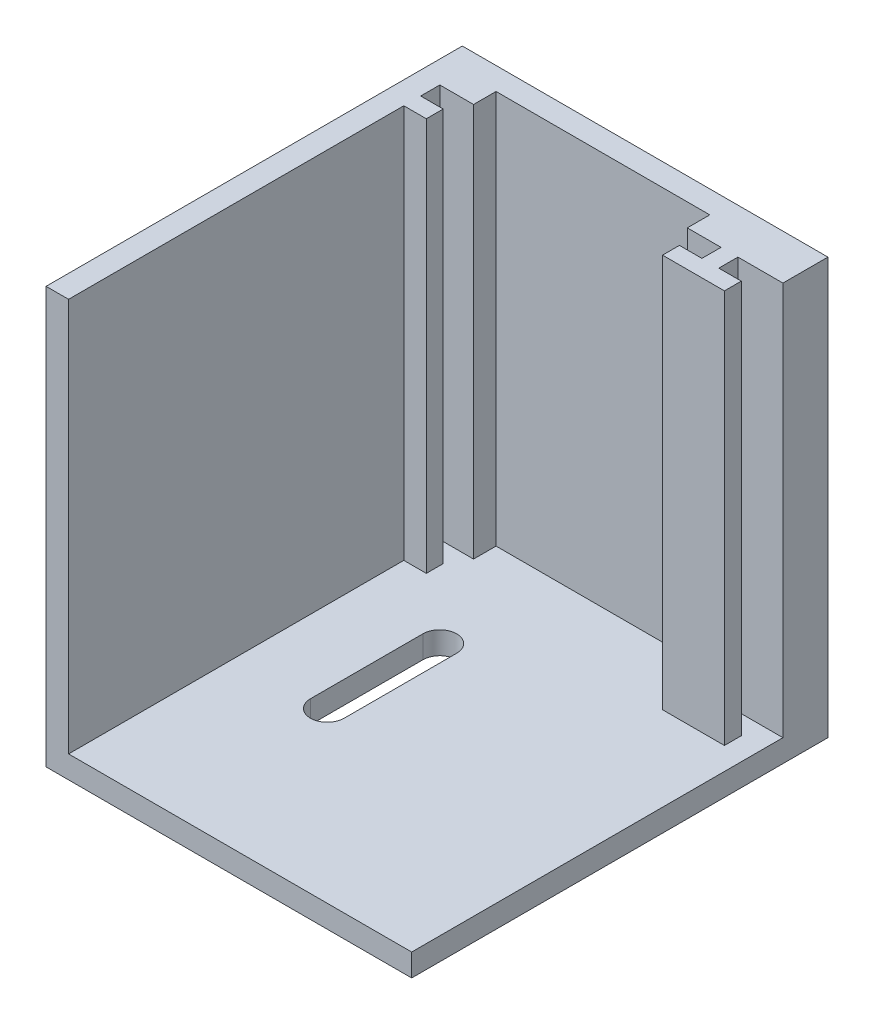
ISO-10303-21;
HEADER;
FILE_DESCRIPTION(('STEP AP214'),'2;1');
FILE_NAME('part.step','',(''),(''),'','','');
FILE_SCHEMA(('AUTOMOTIVE_DESIGN { 1 0 10303 214 1 1 1 1 }'));
ENDSEC;
DATA;
#1=APPLICATION_CONTEXT('core data for automotive mechanical design processes');
#2=APPLICATION_PROTOCOL_DEFINITION('international standard','automotive_design',2000,#1);
#3=PRODUCT_CONTEXT('',#1,'mechanical');
#4=PRODUCT('Part','Part','',(#3));
#5=PRODUCT_RELATED_PRODUCT_CATEGORY('part','',(#4));
#6=PRODUCT_DEFINITION_FORMATION('','',#4);
#7=PRODUCT_DEFINITION_CONTEXT('part definition',#1,'design');
#8=PRODUCT_DEFINITION('design','',#6,#7);
#9=PRODUCT_DEFINITION_SHAPE('','',#8);
#10=(LENGTH_UNIT() NAMED_UNIT(*) SI_UNIT(.MILLI.,.METRE.));
#11=(NAMED_UNIT(*) PLANE_ANGLE_UNIT() SI_UNIT($,.RADIAN.));
#12=(NAMED_UNIT(*) SI_UNIT($,.STERADIAN.) SOLID_ANGLE_UNIT());
#13=UNCERTAINTY_MEASURE_WITH_UNIT(LENGTH_MEASURE(1.E-05),#10,'distance_accuracy_value','');
#14=(GEOMETRIC_REPRESENTATION_CONTEXT(3) GLOBAL_UNCERTAINTY_ASSIGNED_CONTEXT((#13)) GLOBAL_UNIT_ASSIGNED_CONTEXT((#10,
#11,#12)) REPRESENTATION_CONTEXT('',''));
#15=CARTESIAN_POINT('',(0.,0.,0.));
#16=DIRECTION('',(0.,0.,1.));
#17=DIRECTION('',(1.,0.,0.));
#18=AXIS2_PLACEMENT_3D('',#15,#16,#17);
#19=CARTESIAN_POINT('',(14.,-16.,0.));
#20=DIRECTION('',(-1.,0.,0.));
#21=DIRECTION('',(0.,-1.,0.));
#22=AXIS2_PLACEMENT_3D('',#19,#20,#21);
#23=PLANE('',#22);
#24=DIRECTION('',(0.,1.,0.));
#25=VECTOR('',#24,1.);
#26=CARTESIAN_POINT('',(14.,-16.,4.));
#27=LINE('',#26,#25);
#28=CARTESIAN_POINT('',(14.,-16.,4.));
#29=VERTEX_POINT('',#28);
#30=CARTESIAN_POINT('',(14.,19.,4.));
#31=VERTEX_POINT('',#30);
#32=EDGE_CURVE('E59',#29,#31,#27,.T.);
#33=ORIENTED_EDGE('',*,*,#32,.T.);
#34=DIRECTION('',(0.,0.,1.));
#35=VECTOR('',#34,1.);
#36=CARTESIAN_POINT('',(14.,19.,2.));
#37=LINE('',#36,#35);
#38=CARTESIAN_POINT('',(14.,19.,5.7));
#39=VERTEX_POINT('',#38);
#40=EDGE_CURVE('E270',#31,#39,#37,.T.);
#41=ORIENTED_EDGE('',*,*,#40,.T.);
#42=DIRECTION('',(0.,1.,0.));
#43=VECTOR('',#42,1.);
#44=CARTESIAN_POINT('',(14.,-16.,5.7));
#45=LINE('',#44,#43);
#46=CARTESIAN_POINT('',(14.,-16.,5.70000000000001));
#47=VERTEX_POINT('',#46);
#48=EDGE_CURVE('E436',#47,#39,#45,.T.);
#49=ORIENTED_EDGE('',*,*,#48,.F.);
#50=DIRECTION('',(0.,0.,1.));
#51=VECTOR('',#50,1.);
#52=CARTESIAN_POINT('',(14.,-16.,2.));
#53=LINE('',#52,#51);
#54=EDGE_CURVE('E271',#29,#47,#53,.T.);
#55=ORIENTED_EDGE('',*,*,#54,.F.);
#56=EDGE_LOOP('',(#33,#41,#49,#55));
#57=FACE_BOUND('',#56,.T.);
#58=ADVANCED_FACE('F37',(#57),#23,.F.);
#59=CARTESIAN_POINT('',(-14.4999999999999,-16.,37.));
#60=DIRECTION('',(0.,-1.,0.));
#61=DIRECTION('',(0.,0.,-1.));
#62=AXIS2_PLACEMENT_3D('',#59,#60,#61);
#63=PLANE('',#62);
#64=DIRECTION('',(0.,0.,-1.));
#65=VECTOR('',#64,1.);
#66=CARTESIAN_POINT('',(-5.99999999999989,-16.,37.));
#67=LINE('',#66,#65);
#68=CARTESIAN_POINT('',(-5.99999999999989,-16.,22.));
#69=VERTEX_POINT('',#68);
#70=CARTESIAN_POINT('',(-5.99999999999989,-16.,12.));
#71=VERTEX_POINT('',#70);
#72=EDGE_CURVE('E45',#69,#71,#67,.T.);
#73=ORIENTED_EDGE('',*,*,#72,.T.);
#74=CARTESIAN_POINT('',(-4.49999999999989,-16.,12.));
#75=DIRECTION('',(0.,-1.,0.));
#76=DIRECTION('',(0.,0.,-1.));
#77=AXIS2_PLACEMENT_3D('',#74,#75,#76);
#78=CIRCLE('',#77,1.5);
#79=CARTESIAN_POINT('',(-2.99999999999989,-16.,12.));
#80=VERTEX_POINT('',#79);
#81=EDGE_CURVE('E11',#71,#80,#78,.T.);
#82=ORIENTED_EDGE('',*,*,#81,.T.);
#83=DIRECTION('',(0.,0.,1.));
#84=VECTOR('',#83,1.);
#85=CARTESIAN_POINT('',(-2.9999999999999,-16.,37.));
#86=LINE('',#85,#84);
#87=CARTESIAN_POINT('',(-2.9999999999999,-16.,22.));
#88=VERTEX_POINT('',#87);
#89=EDGE_CURVE('E375',#80,#88,#86,.T.);
#90=ORIENTED_EDGE('',*,*,#89,.T.);
#91=CARTESIAN_POINT('',(-4.49999999999989,-16.,22.));
#92=DIRECTION('',(0.,-1.,0.));
#93=DIRECTION('',(0.,0.,-1.));
#94=AXIS2_PLACEMENT_3D('',#91,#92,#93);
#95=CIRCLE('',#94,1.5);
#96=EDGE_CURVE('E378',#88,#69,#95,.T.);
#97=ORIENTED_EDGE('',*,*,#96,.T.);
#98=EDGE_LOOP('',(#73,#82,#90,#97));
#99=FACE_BOUND('',#98,.T.);
#100=DIRECTION('',(0.,0.,-1.));
#101=VECTOR('',#100,1.);
#102=CARTESIAN_POINT('',(18.0000000000001,-16.,37.));
#103=LINE('',#102,#101);
#104=CARTESIAN_POINT('',(18.0000000000001,-16.,37.));
#105=VERTEX_POINT('',#104);
#106=CARTESIAN_POINT('',(18.,-16.,4.));
#107=VERTEX_POINT('',#106);
#108=EDGE_CURVE('E227',#105,#107,#103,.T.);
#109=ORIENTED_EDGE('',*,*,#108,.T.);
#110=DIRECTION('',(-1.,0.,0.));
#111=VECTOR('',#110,1.);
#112=CARTESIAN_POINT('',(14.,-16.,4.));
#113=LINE('',#112,#111);
#114=EDGE_CURVE('E52',#107,#29,#113,.T.);
#115=ORIENTED_EDGE('',*,*,#114,.T.);
#116=ORIENTED_EDGE('',*,*,#54,.T.);
#117=DIRECTION('',(1.,0.,0.));
#118=VECTOR('',#117,1.);
#119=CARTESIAN_POINT('',(14.,-16.,5.7));
#120=LINE('',#119,#118);
#121=CARTESIAN_POINT('',(16.,-16.,5.7));
#122=VERTEX_POINT('',#121);
#123=EDGE_CURVE('E421',#47,#122,#120,.T.);
#124=ORIENTED_EDGE('',*,*,#123,.T.);
#125=DIRECTION('',(0.,0.,1.));
#126=VECTOR('',#125,1.);
#127=CARTESIAN_POINT('',(16.,-16.,7.2));
#128=LINE('',#127,#126);
#129=CARTESIAN_POINT('',(16.,-16.,7.2));
#130=VERTEX_POINT('',#129);
#131=EDGE_CURVE('E423',#122,#130,#128,.T.);
#132=ORIENTED_EDGE('',*,*,#131,.T.);
#133=DIRECTION('',(-1.,0.,0.));
#134=VECTOR('',#133,1.);
#135=CARTESIAN_POINT('',(0.,-16.,7.2));
#136=LINE('',#135,#134);
#137=CARTESIAN_POINT('',(10.5,-16.,7.2));
#138=VERTEX_POINT('',#137);
#139=EDGE_CURVE('E282',#130,#138,#136,.T.);
#140=ORIENTED_EDGE('',*,*,#139,.T.);
#141=DIRECTION('',(0.,0.,1.));
#142=VECTOR('',#141,1.);
#143=CARTESIAN_POINT('',(10.5,-16.,0.));
#144=LINE('',#143,#142);
#145=CARTESIAN_POINT('',(10.5,-16.,5.7));
#146=VERTEX_POINT('',#145);
#147=EDGE_CURVE('E293',#146,#138,#144,.T.);
#148=ORIENTED_EDGE('',*,*,#147,.F.);
#149=DIRECTION('',(-1.,0.,0.));
#150=VECTOR('',#149,1.);
#151=CARTESIAN_POINT('',(0.,-16.,5.7));
#152=LINE('',#151,#150);
#153=CARTESIAN_POINT('',(12.5,-16.,5.7));
#154=VERTEX_POINT('',#153);
#155=EDGE_CURVE('E288',#154,#146,#152,.T.);
#156=ORIENTED_EDGE('',*,*,#155,.F.);
#157=DIRECTION('',(0.,0.,1.));
#158=VECTOR('',#157,1.);
#159=CARTESIAN_POINT('',(12.5,-16.,2.));
#160=LINE('',#159,#158);
#161=CARTESIAN_POINT('',(12.5,-16.,4.));
#162=VERTEX_POINT('',#161);
#163=EDGE_CURVE('E274',#162,#154,#160,.T.);
#164=ORIENTED_EDGE('',*,*,#163,.F.);
#165=DIRECTION('',(1.,0.,0.));
#166=VECTOR('',#165,1.);
#167=CARTESIAN_POINT('',(12.5,-16.,4.));
#168=LINE('',#167,#166);
#169=CARTESIAN_POINT('',(9.5,-16.,4.));
#170=VERTEX_POINT('',#169);
#171=EDGE_CURVE('E333',#170,#162,#168,.T.);
#172=ORIENTED_EDGE('',*,*,#171,.F.);
#173=DIRECTION('',(0.,0.,-1.));
#174=VECTOR('',#173,1.);
#175=CARTESIAN_POINT('',(9.5,-16.,4.));
#176=LINE('',#175,#174);
#177=CARTESIAN_POINT('',(9.5,-16.,2.));
#178=VERTEX_POINT('',#177);
#179=EDGE_CURVE('E336',#170,#178,#176,.T.);
#180=ORIENTED_EDGE('',*,*,#179,.T.);
#181=DIRECTION('',(1.,0.,0.));
#182=VECTOR('',#181,1.);
#183=CARTESIAN_POINT('',(-14.4999999999999,-16.,2.));
#184=LINE('',#183,#182);
#185=CARTESIAN_POINT('',(-9.5,-16.,2.));
#186=VERTEX_POINT('',#185);
#187=EDGE_CURVE('E364',#186,#178,#184,.T.);
#188=ORIENTED_EDGE('',*,*,#187,.F.);
#189=DIRECTION('',(0.,0.,-1.));
#190=VECTOR('',#189,1.);
#191=CARTESIAN_POINT('',(-9.5,-16.,4.));
#192=LINE('',#191,#190);
#193=CARTESIAN_POINT('',(-9.5,-16.,4.));
#194=VERTEX_POINT('',#193);
#195=EDGE_CURVE('E360',#194,#186,#192,.T.);
#196=ORIENTED_EDGE('',*,*,#195,.F.);
#197=DIRECTION('',(1.,0.,0.));
#198=VECTOR('',#197,1.);
#199=CARTESIAN_POINT('',(-12.5,-16.,4.));
#200=LINE('',#199,#198);
#201=CARTESIAN_POINT('',(-12.5,-16.,4.));
#202=VERTEX_POINT('',#201);
#203=EDGE_CURVE('E347',#202,#194,#200,.T.);
#204=ORIENTED_EDGE('',*,*,#203,.F.);
#205=DIRECTION('',(0.,0.,1.));
#206=VECTOR('',#205,1.);
#207=CARTESIAN_POINT('',(-12.5,-16.,0.));
#208=LINE('',#207,#206);
#209=CARTESIAN_POINT('',(-12.5,-16.,5.7));
#210=VERTEX_POINT('',#209);
#211=EDGE_CURVE('E303',#202,#210,#208,.T.);
#212=ORIENTED_EDGE('',*,*,#211,.T.);
#213=DIRECTION('',(1.,0.,0.));
#214=VECTOR('',#213,1.);
#215=CARTESIAN_POINT('',(0.,-16.,5.7));
#216=LINE('',#215,#214);
#217=CARTESIAN_POINT('',(-10.5,-16.,5.7));
#218=VERTEX_POINT('',#217);
#219=EDGE_CURVE('E300',#210,#218,#216,.T.);
#220=ORIENTED_EDGE('',*,*,#219,.T.);
#221=DIRECTION('',(0.,0.,1.));
#222=VECTOR('',#221,1.);
#223=CARTESIAN_POINT('',(-10.5,-16.,0.));
#224=LINE('',#223,#222);
#225=CARTESIAN_POINT('',(-10.5,-16.,7.2));
#226=VERTEX_POINT('',#225);
#227=EDGE_CURVE('E298',#218,#226,#224,.T.);
#228=ORIENTED_EDGE('',*,*,#227,.T.);
#229=DIRECTION('',(1.,0.,0.));
#230=VECTOR('',#229,1.);
#231=CARTESIAN_POINT('',(0.,-16.,7.2));
#232=LINE('',#231,#230);
#233=CARTESIAN_POINT('',(-12.4999999999999,-16.,7.2));
#234=VERTEX_POINT('',#233);
#235=EDGE_CURVE('E305',#234,#226,#232,.T.);
#236=ORIENTED_EDGE('',*,*,#235,.F.);
#237=DIRECTION('',(0.,0.,-1.));
#238=VECTOR('',#237,1.);
#239=CARTESIAN_POINT('',(-12.4999999999999,-16.,37.));
#240=LINE('',#239,#238);
#241=CARTESIAN_POINT('',(-12.4999999999999,-16.,37.));
#242=VERTEX_POINT('',#241);
#243=EDGE_CURVE('E258',#242,#234,#240,.T.);
#244=ORIENTED_EDGE('',*,*,#243,.F.);
#245=DIRECTION('',(-1.,0.,0.));
#246=VECTOR('',#245,1.);
#247=CARTESIAN_POINT('',(-14.4999999999999,-16.,37.));
#248=LINE('',#247,#246);
#249=EDGE_CURVE('E234',#105,#242,#248,.T.);
#250=ORIENTED_EDGE('',*,*,#249,.F.);
#251=EDGE_LOOP('',(#109,#115,#116,#124,#132,#140,#148,#156,#164,#172,#180,#188,#196,#204,#212,
#220,#228,#236,#244,#250));
#252=FACE_BOUND('',#251,.T.);
#253=ADVANCED_FACE('F232',(#99,#252),#63,.F.);
#254=CARTESIAN_POINT('',(0.,-16.,7.2));
#255=DIRECTION('',(0.,0.,1.));
#256=DIRECTION('',(1.,0.,0.));
#257=AXIS2_PLACEMENT_3D('',#254,#255,#256);
#258=PLANE('',#257);
#259=DIRECTION('',(1.,0.,0.));
#260=VECTOR('',#259,1.);
#261=CARTESIAN_POINT('',(0.,19.,7.2));
#262=LINE('',#261,#260);
#263=CARTESIAN_POINT('',(-12.4999999999999,19.,7.2));
#264=VERTEX_POINT('',#263);
#265=CARTESIAN_POINT('',(-10.5,19.,7.2));
#266=VERTEX_POINT('',#265);
#267=EDGE_CURVE('E301',#264,#266,#262,.T.);
#268=ORIENTED_EDGE('',*,*,#267,.F.);
#269=DIRECTION('',(0.,-1.,0.));
#270=VECTOR('',#269,1.);
#271=CARTESIAN_POINT('',(-12.4999999999999,-16.,7.2));
#272=LINE('',#271,#270);
#273=EDGE_CURVE('E261',#264,#234,#272,.T.);
#274=ORIENTED_EDGE('',*,*,#273,.T.);
#275=ORIENTED_EDGE('',*,*,#235,.T.);
#276=DIRECTION('',(0.,1.,0.));
#277=VECTOR('',#276,1.);
#278=CARTESIAN_POINT('',(-10.5,-16.,7.2));
#279=LINE('',#278,#277);
#280=EDGE_CURVE('E316',#226,#266,#279,.T.);
#281=ORIENTED_EDGE('',*,*,#280,.T.);
#282=EDGE_LOOP('',(#268,#274,#275,#281));
#283=FACE_BOUND('',#282,.T.);
#284=ADVANCED_FACE('F470',(#283),#258,.T.);
#285=CARTESIAN_POINT('',(0.,0.,2.));
#286=DIRECTION('',(0.,0.,-1.));
#287=DIRECTION('',(-1.,0.,0.));
#288=AXIS2_PLACEMENT_3D('',#285,#286,#287);
#289=PLANE('',#288);
#290=DIRECTION('',(0.,-1.,0.));
#291=VECTOR('',#290,1.);
#292=CARTESIAN_POINT('',(9.5,19.,2.));
#293=LINE('',#292,#291);
#294=CARTESIAN_POINT('',(9.5,19.,2.));
#295=VERTEX_POINT('',#294);
#296=EDGE_CURVE('E319',#295,#178,#293,.T.);
#297=ORIENTED_EDGE('',*,*,#296,.F.);
#298=DIRECTION('',(-1.,0.,0.));
#299=VECTOR('',#298,1.);
#300=CARTESIAN_POINT('',(-14.5,19.,2.));
#301=LINE('',#300,#299);
#302=CARTESIAN_POINT('',(-9.50000000000001,19.,2.));
#303=VERTEX_POINT('',#302);
#304=EDGE_CURVE('E367',#295,#303,#301,.T.);
#305=ORIENTED_EDGE('',*,*,#304,.T.);
#306=DIRECTION('',(0.,1.,0.));
#307=VECTOR('',#306,1.);
#308=CARTESIAN_POINT('',(-9.50000000000001,19.,2.));
#309=LINE('',#308,#307);
#310=EDGE_CURVE('E343',#186,#303,#309,.T.);
#311=ORIENTED_EDGE('',*,*,#310,.F.);
#312=ORIENTED_EDGE('',*,*,#187,.T.);
#313=EDGE_LOOP('',(#297,#305,#311,#312));
#314=FACE_BOUND('',#313,.T.);
#315=ADVANCED_FACE('F491',(#314),#289,.F.);
#316=CARTESIAN_POINT('',(-14.4999999999999,-16.,2.));
#317=DIRECTION('',(1.,0.,0.));
#318=DIRECTION('',(0.,1.,0.));
#319=AXIS2_PLACEMENT_3D('',#316,#317,#318);
#320=PLANE('',#319);
#321=DIRECTION('',(0.,-1.,0.));
#322=VECTOR('',#321,1.);
#323=CARTESIAN_POINT('',(-14.4999999999999,-16.,0.));
#324=LINE('',#323,#322);
#325=CARTESIAN_POINT('',(-14.5,19.,0.));
#326=VERTEX_POINT('',#325);
#327=CARTESIAN_POINT('',(-14.4999999999999,-18.,0.));
#328=VERTEX_POINT('',#327);
#329=EDGE_CURVE('E363',#326,#328,#324,.T.);
#330=ORIENTED_EDGE('',*,*,#329,.T.);
#331=DIRECTION('',(0.,0.,-1.));
#332=VECTOR('',#331,1.);
#333=CARTESIAN_POINT('',(-14.4999999999999,-18.,37.));
#334=LINE('',#333,#332);
#335=CARTESIAN_POINT('',(-14.4999999999999,-18.,37.));
#336=VERTEX_POINT('',#335);
#337=EDGE_CURVE('E238',#336,#328,#334,.T.);
#338=ORIENTED_EDGE('',*,*,#337,.F.);
#339=DIRECTION('',(0.,-1.,0.));
#340=VECTOR('',#339,1.);
#341=CARTESIAN_POINT('',(-14.4999999999999,-16.,37.));
#342=LINE('',#341,#340);
#343=CARTESIAN_POINT('',(-14.4999999999999,19.,37.));
#344=VERTEX_POINT('',#343);
#345=EDGE_CURVE('E248',#344,#336,#342,.T.);
#346=ORIENTED_EDGE('',*,*,#345,.F.);
#347=DIRECTION('',(0.,0.,-1.));
#348=VECTOR('',#347,1.);
#349=CARTESIAN_POINT('',(-14.5,19.,2.));
#350=LINE('',#349,#348);
#351=EDGE_CURVE('E370',#344,#326,#350,.T.);
#352=ORIENTED_EDGE('',*,*,#351,.T.);
#353=EDGE_LOOP('',(#330,#338,#346,#352));
#354=FACE_BOUND('',#353,.T.);
#355=ADVANCED_FACE('F39',(#354),#320,.F.);
#356=CARTESIAN_POINT('',(-14.5,19.,2.));
#357=DIRECTION('',(0.,-1.,0.));
#358=DIRECTION('',(0.,0.,-1.));
#359=AXIS2_PLACEMENT_3D('',#356,#357,#358);
#360=PLANE('',#359);
#361=DIRECTION('',(0.,0.,1.));
#362=VECTOR('',#361,1.);
#363=CARTESIAN_POINT('',(18.,19.,0.));
#364=LINE('',#363,#362);
#365=CARTESIAN_POINT('',(18.,19.,0.));
#366=VERTEX_POINT('',#365);
#367=CARTESIAN_POINT('',(18.,19.,4.));
#368=VERTEX_POINT('',#367);
#369=EDGE_CURVE('E230',#366,#368,#364,.T.);
#370=ORIENTED_EDGE('',*,*,#369,.F.);
#371=DIRECTION('',(-1.,0.,0.));
#372=VECTOR('',#371,1.);
#373=CARTESIAN_POINT('',(-14.5,19.,0.));
#374=LINE('',#373,#372);
#375=EDGE_CURVE('E368',#366,#326,#374,.T.);
#376=ORIENTED_EDGE('',*,*,#375,.T.);
#377=ORIENTED_EDGE('',*,*,#351,.F.);
#378=DIRECTION('',(-1.,0.,0.));
#379=VECTOR('',#378,1.);
#380=CARTESIAN_POINT('',(-14.4999999999999,19.,37.));
#381=LINE('',#380,#379);
#382=CARTESIAN_POINT('',(-12.4999999999999,19.,37.));
#383=VERTEX_POINT('',#382);
#384=EDGE_CURVE('E252',#383,#344,#381,.T.);
#385=ORIENTED_EDGE('',*,*,#384,.F.);
#386=DIRECTION('',(0.,0.,-1.));
#387=VECTOR('',#386,1.);
#388=CARTESIAN_POINT('',(-12.4999999999999,19.,37.));
#389=LINE('',#388,#387);
#390=EDGE_CURVE('E255',#383,#264,#389,.T.);
#391=ORIENTED_EDGE('',*,*,#390,.T.);
#392=ORIENTED_EDGE('',*,*,#267,.T.);
#393=DIRECTION('',(0.,0.,1.));
#394=VECTOR('',#393,1.);
#395=CARTESIAN_POINT('',(-10.5,19.,0.));
#396=LINE('',#395,#394);
#397=CARTESIAN_POINT('',(-10.5,19.,5.7));
#398=VERTEX_POINT('',#397);
#399=EDGE_CURVE('E273',#398,#266,#396,.T.);
#400=ORIENTED_EDGE('',*,*,#399,.F.);
#401=DIRECTION('',(1.,0.,0.));
#402=VECTOR('',#401,1.);
#403=CARTESIAN_POINT('',(0.,19.,5.7));
#404=LINE('',#403,#402);
#405=CARTESIAN_POINT('',(-12.5,19.,5.7));
#406=VERTEX_POINT('',#405);
#407=EDGE_CURVE('E311',#406,#398,#404,.T.);
#408=ORIENTED_EDGE('',*,*,#407,.F.);
#409=DIRECTION('',(0.,0.,1.));
#410=VECTOR('',#409,1.);
#411=CARTESIAN_POINT('',(-12.5,19.,0.));
#412=LINE('',#411,#410);
#413=CARTESIAN_POINT('',(-12.5,19.,4.));
#414=VERTEX_POINT('',#413);
#415=EDGE_CURVE('E313',#414,#406,#412,.T.);
#416=ORIENTED_EDGE('',*,*,#415,.F.);
#417=DIRECTION('',(-1.,0.,0.));
#418=VECTOR('',#417,1.);
#419=CARTESIAN_POINT('',(-12.5,19.,4.));
#420=LINE('',#419,#418);
#421=CARTESIAN_POINT('',(-9.50000000000001,19.,4.));
#422=VERTEX_POINT('',#421);
#423=EDGE_CURVE('E352',#422,#414,#420,.T.);
#424=ORIENTED_EDGE('',*,*,#423,.F.);
#425=DIRECTION('',(0.,0.,-1.));
#426=VECTOR('',#425,1.);
#427=CARTESIAN_POINT('',(-9.50000000000001,19.,4.));
#428=LINE('',#427,#426);
#429=EDGE_CURVE('E355',#422,#303,#428,.T.);
#430=ORIENTED_EDGE('',*,*,#429,.T.);
#431=ORIENTED_EDGE('',*,*,#304,.F.);
#432=DIRECTION('',(0.,0.,-1.));
#433=VECTOR('',#432,1.);
#434=CARTESIAN_POINT('',(9.5,19.,4.));
#435=LINE('',#434,#433);
#436=CARTESIAN_POINT('',(9.5,19.,4.));
#437=VERTEX_POINT('',#436);
#438=EDGE_CURVE('E340',#437,#295,#435,.T.);
#439=ORIENTED_EDGE('',*,*,#438,.F.);
#440=DIRECTION('',(-1.,0.,0.));
#441=VECTOR('',#440,1.);
#442=CARTESIAN_POINT('',(12.5,19.,4.));
#443=LINE('',#442,#441);
#444=CARTESIAN_POINT('',(12.5,19.,4.));
#445=VERTEX_POINT('',#444);
#446=EDGE_CURVE('E328',#445,#437,#443,.T.);
#447=ORIENTED_EDGE('',*,*,#446,.F.);
#448=DIRECTION('',(0.,0.,1.));
#449=VECTOR('',#448,1.);
#450=CARTESIAN_POINT('',(12.5,19.,2.));
#451=LINE('',#450,#449);
#452=CARTESIAN_POINT('',(12.5,19.,5.7));
#453=VERTEX_POINT('',#452);
#454=EDGE_CURVE('E268',#445,#453,#451,.T.);
#455=ORIENTED_EDGE('',*,*,#454,.T.);
#456=DIRECTION('',(-1.,0.,0.));
#457=VECTOR('',#456,1.);
#458=CARTESIAN_POINT('',(0.,19.,5.7));
#459=LINE('',#458,#457);
#460=CARTESIAN_POINT('',(10.5,19.,5.7));
#461=VERTEX_POINT('',#460);
#462=EDGE_CURVE('E277',#453,#461,#459,.T.);
#463=ORIENTED_EDGE('',*,*,#462,.T.);
#464=DIRECTION('',(0.,0.,1.));
#465=VECTOR('',#464,1.);
#466=CARTESIAN_POINT('',(10.5,19.,0.));
#467=LINE('',#466,#465);
#468=CARTESIAN_POINT('',(10.5,19.,7.2));
#469=VERTEX_POINT('',#468);
#470=EDGE_CURVE('E287',#461,#469,#467,.T.);
#471=ORIENTED_EDGE('',*,*,#470,.T.);
#472=DIRECTION('',(-1.,0.,0.));
#473=VECTOR('',#472,1.);
#474=CARTESIAN_POINT('',(0.,19.,7.2));
#475=LINE('',#474,#473);
#476=CARTESIAN_POINT('',(16.,19.,7.2));
#477=VERTEX_POINT('',#476);
#478=EDGE_CURVE('E284',#477,#469,#475,.T.);
#479=ORIENTED_EDGE('',*,*,#478,.F.);
#480=DIRECTION('',(0.,0.,1.));
#481=VECTOR('',#480,1.);
#482=CARTESIAN_POINT('',(16.,19.,7.2));
#483=LINE('',#482,#481);
#484=CARTESIAN_POINT('',(16.,19.,5.7));
#485=VERTEX_POINT('',#484);
#486=EDGE_CURVE('E424',#485,#477,#483,.T.);
#487=ORIENTED_EDGE('',*,*,#486,.F.);
#488=DIRECTION('',(1.,0.,0.));
#489=VECTOR('',#488,1.);
#490=CARTESIAN_POINT('',(14.,19.,5.7));
#491=LINE('',#490,#489);
#492=EDGE_CURVE('E420',#39,#485,#491,.T.);
#493=ORIENTED_EDGE('',*,*,#492,.F.);
#494=ORIENTED_EDGE('',*,*,#40,.F.);
#495=DIRECTION('',(-1.,0.,0.));
#496=VECTOR('',#495,1.);
#497=CARTESIAN_POINT('',(14.,19.,4.));
#498=LINE('',#497,#496);
#499=EDGE_CURVE('E220',#368,#31,#498,.T.);
#500=ORIENTED_EDGE('',*,*,#499,.F.);
#501=EDGE_LOOP('',(#370,#376,#377,#385,#391,#392,#400,#408,#416,#424,#430,#431,#439,#447,#455,
#463,#471,#479,#487,#493,#494,#500));
#502=FACE_BOUND('',#501,.T.);
#503=ADVANCED_FACE('F415',(#502),#360,.F.);
#504=CARTESIAN_POINT('',(0.,0.,0.));
#505=DIRECTION('',(0.,0.,-1.));
#506=DIRECTION('',(-1.,0.,0.));
#507=AXIS2_PLACEMENT_3D('',#504,#505,#506);
#508=PLANE('',#507);
#509=ORIENTED_EDGE('',*,*,#375,.F.);
#510=DIRECTION('',(0.,1.,0.));
#511=VECTOR('',#510,1.);
#512=CARTESIAN_POINT('',(18.0000000000001,-16.,0.));
#513=LINE('',#512,#511);
#514=CARTESIAN_POINT('',(18.0000000000001,-18.,0.));
#515=VERTEX_POINT('',#514);
#516=EDGE_CURVE('E243',#515,#366,#513,.T.);
#517=ORIENTED_EDGE('',*,*,#516,.F.);
#518=DIRECTION('',(1.,0.,0.));
#519=VECTOR('',#518,1.);
#520=CARTESIAN_POINT('',(-14.4999999999999,-18.,0.));
#521=LINE('',#520,#519);
#522=EDGE_CURVE('E398',#328,#515,#521,.T.);
#523=ORIENTED_EDGE('',*,*,#522,.F.);
#524=ORIENTED_EDGE('',*,*,#329,.F.);
#525=EDGE_LOOP('',(#509,#517,#523,#524));
#526=FACE_BOUND('',#525,.T.);
#527=ADVANCED_FACE('F520',(#526),#508,.T.);
#528=CARTESIAN_POINT('',(-9.50000000000001,19.,4.));
#529=DIRECTION('',(-1.,0.,0.));
#530=DIRECTION('',(0.,-1.,0.));
#531=AXIS2_PLACEMENT_3D('',#528,#529,#530);
#532=PLANE('',#531);
#533=ORIENTED_EDGE('',*,*,#310,.T.);
#534=ORIENTED_EDGE('',*,*,#429,.F.);
#535=DIRECTION('',(0.,1.,0.));
#536=VECTOR('',#535,1.);
#537=CARTESIAN_POINT('',(-9.50000000000001,19.,4.));
#538=LINE('',#537,#536);
#539=EDGE_CURVE('E350',#194,#422,#538,.T.);
#540=ORIENTED_EDGE('',*,*,#539,.F.);
#541=ORIENTED_EDGE('',*,*,#195,.T.);
#542=EDGE_LOOP('',(#533,#534,#540,#541));
#543=FACE_BOUND('',#542,.T.);
#544=ADVANCED_FACE('F516',(#543),#532,.F.);
#545=CARTESIAN_POINT('',(0.,0.,4.));
#546=DIRECTION('',(0.,0.,1.));
#547=DIRECTION('',(1.,0.,0.));
#548=AXIS2_PLACEMENT_3D('',#545,#546,#547);
#549=PLANE('',#548);
#550=DIRECTION('',(0.,-1.,0.));
#551=VECTOR('',#550,1.);
#552=CARTESIAN_POINT('',(-12.5,19.,4.));
#553=LINE('',#552,#551);
#554=EDGE_CURVE('E344',#414,#202,#553,.T.);
#555=ORIENTED_EDGE('',*,*,#554,.T.);
#556=ORIENTED_EDGE('',*,*,#203,.T.);
#557=ORIENTED_EDGE('',*,*,#539,.T.);
#558=ORIENTED_EDGE('',*,*,#423,.T.);
#559=EDGE_LOOP('',(#555,#556,#557,#558));
#560=FACE_BOUND('',#559,.T.);
#561=ADVANCED_FACE('F512',(#560),#549,.T.);
#562=CARTESIAN_POINT('',(9.5,19.,4.));
#563=DIRECTION('',(1.,0.,0.));
#564=DIRECTION('',(0.,1.,0.));
#565=AXIS2_PLACEMENT_3D('',#562,#563,#564);
#566=PLANE('',#565);
#567=ORIENTED_EDGE('',*,*,#296,.T.);
#568=ORIENTED_EDGE('',*,*,#179,.F.);
#569=DIRECTION('',(0.,-1.,0.));
#570=VECTOR('',#569,1.);
#571=CARTESIAN_POINT('',(9.5,19.,4.));
#572=LINE('',#571,#570);
#573=EDGE_CURVE('E330',#437,#170,#572,.T.);
#574=ORIENTED_EDGE('',*,*,#573,.F.);
#575=ORIENTED_EDGE('',*,*,#438,.T.);
#576=EDGE_LOOP('',(#567,#568,#574,#575));
#577=FACE_BOUND('',#576,.T.);
#578=ADVANCED_FACE('F508',(#577),#566,.F.);
#579=CARTESIAN_POINT('',(0.,0.,4.));
#580=DIRECTION('',(0.,0.,-1.));
#581=DIRECTION('',(-1.,0.,0.));
#582=AXIS2_PLACEMENT_3D('',#579,#580,#581);
#583=PLANE('',#582);
#584=DIRECTION('',(0.,1.,0.));
#585=VECTOR('',#584,1.);
#586=CARTESIAN_POINT('',(12.5,19.,4.));
#587=LINE('',#586,#585);
#588=EDGE_CURVE('E325',#162,#445,#587,.T.);
#589=ORIENTED_EDGE('',*,*,#588,.T.);
#590=ORIENTED_EDGE('',*,*,#446,.T.);
#591=ORIENTED_EDGE('',*,*,#573,.T.);
#592=ORIENTED_EDGE('',*,*,#171,.T.);
#593=EDGE_LOOP('',(#589,#590,#591,#592));
#594=FACE_BOUND('',#593,.T.);
#595=ADVANCED_FACE('F504',(#594),#583,.F.);
#596=CARTESIAN_POINT('',(-10.5,-16.,0.));
#597=DIRECTION('',(-1.,0.,0.));
#598=DIRECTION('',(0.,0.,1.));
#599=AXIS2_PLACEMENT_3D('',#596,#597,#598);
#600=PLANE('',#599);
#601=ORIENTED_EDGE('',*,*,#399,.T.);
#602=ORIENTED_EDGE('',*,*,#280,.F.);
#603=ORIENTED_EDGE('',*,*,#227,.F.);
#604=DIRECTION('',(0.,1.,0.));
#605=VECTOR('',#604,1.);
#606=CARTESIAN_POINT('',(-10.5,-16.,5.7));
#607=LINE('',#606,#605);
#608=EDGE_CURVE('E308',#218,#398,#607,.T.);
#609=ORIENTED_EDGE('',*,*,#608,.T.);
#610=EDGE_LOOP('',(#601,#602,#603,#609));
#611=FACE_BOUND('',#610,.T.);
#612=ADVANCED_FACE('F497',(#611),#600,.F.);
#613=CARTESIAN_POINT('',(-12.5,-16.,0.));
#614=DIRECTION('',(-1.,0.,0.));
#615=DIRECTION('',(0.,-1.,0.));
#616=AXIS2_PLACEMENT_3D('',#613,#614,#615);
#617=PLANE('',#616);
#618=ORIENTED_EDGE('',*,*,#554,.F.);
#619=ORIENTED_EDGE('',*,*,#415,.T.);
#620=DIRECTION('',(0.,1.,0.));
#621=VECTOR('',#620,1.);
#622=CARTESIAN_POINT('',(-12.5,-16.,5.7));
#623=LINE('',#622,#621);
#624=EDGE_CURVE('E320',#210,#406,#623,.T.);
#625=ORIENTED_EDGE('',*,*,#624,.F.);
#626=ORIENTED_EDGE('',*,*,#211,.F.);
#627=EDGE_LOOP('',(#618,#619,#625,#626));
#628=FACE_BOUND('',#627,.T.);
#629=ADVANCED_FACE('F493',(#628),#617,.F.);
#630=CARTESIAN_POINT('',(0.,-16.,5.7));
#631=DIRECTION('',(0.,0.,1.));
#632=DIRECTION('',(1.,0.,0.));
#633=AXIS2_PLACEMENT_3D('',#630,#631,#632);
#634=PLANE('',#633);
#635=ORIENTED_EDGE('',*,*,#407,.T.);
#636=ORIENTED_EDGE('',*,*,#608,.F.);
#637=ORIENTED_EDGE('',*,*,#219,.F.);
#638=ORIENTED_EDGE('',*,*,#624,.T.);
#639=EDGE_LOOP('',(#635,#636,#637,#638));
#640=FACE_BOUND('',#639,.T.);
#641=ADVANCED_FACE('F496',(#640),#634,.F.);
#642=CARTESIAN_POINT('',(12.5,-16.,2.));
#643=DIRECTION('',(-1.,0.,0.));
#644=DIRECTION('',(0.,-1.,0.));
#645=AXIS2_PLACEMENT_3D('',#642,#643,#644);
#646=PLANE('',#645);
#647=ORIENTED_EDGE('',*,*,#588,.F.);
#648=ORIENTED_EDGE('',*,*,#163,.T.);
#649=DIRECTION('',(0.,1.,0.));
#650=VECTOR('',#649,1.);
#651=CARTESIAN_POINT('',(12.5,-16.,5.7));
#652=LINE('',#651,#650);
#653=EDGE_CURVE('E264',#154,#453,#652,.T.);
#654=ORIENTED_EDGE('',*,*,#653,.T.);
#655=ORIENTED_EDGE('',*,*,#454,.F.);
#656=EDGE_LOOP('',(#647,#648,#654,#655));
#657=FACE_BOUND('',#656,.T.);
#658=ADVANCED_FACE('F474',(#657),#646,.T.);
#659=CARTESIAN_POINT('',(0.,-16.,7.2));
#660=DIRECTION('',(0.,0.,-1.));
#661=DIRECTION('',(-1.,0.,0.));
#662=AXIS2_PLACEMENT_3D('',#659,#660,#661);
#663=PLANE('',#662);
#664=ORIENTED_EDGE('',*,*,#478,.T.);
#665=DIRECTION('',(0.,1.,0.));
#666=VECTOR('',#665,1.);
#667=CARTESIAN_POINT('',(10.5,-16.,7.2));
#668=LINE('',#667,#666);
#669=EDGE_CURVE('E267',#138,#469,#668,.T.);
#670=ORIENTED_EDGE('',*,*,#669,.F.);
#671=ORIENTED_EDGE('',*,*,#139,.F.);
#672=DIRECTION('',(0.,1.,0.));
#673=VECTOR('',#672,1.);
#674=CARTESIAN_POINT('',(16.,-16.,7.2));
#675=LINE('',#674,#673);
#676=EDGE_CURVE('E427',#130,#477,#675,.T.);
#677=ORIENTED_EDGE('',*,*,#676,.T.);
#678=EDGE_LOOP('',(#664,#670,#671,#677));
#679=FACE_BOUND('',#678,.T.);
#680=ADVANCED_FACE('F484',(#679),#663,.F.);
#681=CARTESIAN_POINT('',(10.5,-16.,0.));
#682=DIRECTION('',(-1.,0.,0.));
#683=DIRECTION('',(0.,0.,1.));
#684=AXIS2_PLACEMENT_3D('',#681,#682,#683);
#685=PLANE('',#684);
#686=ORIENTED_EDGE('',*,*,#470,.F.);
#687=DIRECTION('',(0.,1.,0.));
#688=VECTOR('',#687,1.);
#689=CARTESIAN_POINT('',(10.5,-16.,5.7));
#690=LINE('',#689,#688);
#691=EDGE_CURVE('E279',#146,#461,#690,.T.);
#692=ORIENTED_EDGE('',*,*,#691,.F.);
#693=ORIENTED_EDGE('',*,*,#147,.T.);
#694=ORIENTED_EDGE('',*,*,#669,.T.);
#695=EDGE_LOOP('',(#686,#692,#693,#694));
#696=FACE_BOUND('',#695,.T.);
#697=ADVANCED_FACE('F480',(#696),#685,.T.);
#698=CARTESIAN_POINT('',(0.,-16.,5.7));
#699=DIRECTION('',(0.,0.,-1.));
#700=DIRECTION('',(-1.,0.,0.));
#701=AXIS2_PLACEMENT_3D('',#698,#699,#700);
#702=PLANE('',#701);
#703=ORIENTED_EDGE('',*,*,#653,.F.);
#704=ORIENTED_EDGE('',*,*,#155,.T.);
#705=ORIENTED_EDGE('',*,*,#691,.T.);
#706=ORIENTED_EDGE('',*,*,#462,.F.);
#707=EDGE_LOOP('',(#703,#704,#705,#706));
#708=FACE_BOUND('',#707,.T.);
#709=ADVANCED_FACE('F476',(#708),#702,.T.);
#710=CARTESIAN_POINT('',(-12.4999999999999,-16.,37.));
#711=DIRECTION('',(-1.,0.,0.));
#712=DIRECTION('',(0.,0.,1.));
#713=AXIS2_PLACEMENT_3D('',#710,#711,#712);
#714=PLANE('',#713);
#715=ORIENTED_EDGE('',*,*,#273,.F.);
#716=ORIENTED_EDGE('',*,*,#390,.F.);
#717=DIRECTION('',(0.,1.,0.));
#718=VECTOR('',#717,1.);
#719=CARTESIAN_POINT('',(-12.4999999999999,-16.,37.));
#720=LINE('',#719,#718);
#721=EDGE_CURVE('E250',#242,#383,#720,.T.);
#722=ORIENTED_EDGE('',*,*,#721,.F.);
#723=ORIENTED_EDGE('',*,*,#243,.T.);
#724=EDGE_LOOP('',(#715,#716,#722,#723));
#725=FACE_BOUND('',#724,.T.);
#726=ADVANCED_FACE('F479',(#725),#714,.F.);
#727=CARTESIAN_POINT('',(0.,0.,37.));
#728=DIRECTION('',(0.,0.,-1.));
#729=DIRECTION('',(-1.,0.,0.));
#730=AXIS2_PLACEMENT_3D('',#727,#728,#729);
#731=PLANE('',#730);
#732=ORIENTED_EDGE('',*,*,#345,.T.);
#733=DIRECTION('',(1.,0.,0.));
#734=VECTOR('',#733,1.);
#735=CARTESIAN_POINT('',(-14.4999999999999,-18.,37.));
#736=LINE('',#735,#734);
#737=CARTESIAN_POINT('',(18.0000000000001,-18.,37.));
#738=VERTEX_POINT('',#737);
#739=EDGE_CURVE('E407',#336,#738,#736,.T.);
#740=ORIENTED_EDGE('',*,*,#739,.T.);
#741=DIRECTION('',(0.,1.,0.));
#742=VECTOR('',#741,1.);
#743=CARTESIAN_POINT('',(18.0000000000001,-16.,37.));
#744=LINE('',#743,#742);
#745=EDGE_CURVE('E240',#738,#105,#744,.T.);
#746=ORIENTED_EDGE('',*,*,#745,.T.);
#747=ORIENTED_EDGE('',*,*,#249,.T.);
#748=ORIENTED_EDGE('',*,*,#721,.T.);
#749=ORIENTED_EDGE('',*,*,#384,.T.);
#750=EDGE_LOOP('',(#732,#740,#746,#747,#748,#749));
#751=FACE_BOUND('',#750,.T.);
#752=ADVANCED_FACE('F538',(#751),#731,.F.);
#753=CARTESIAN_POINT('',(-14.4999999999999,-18.,37.));
#754=DIRECTION('',(0.,1.,0.));
#755=DIRECTION('',(0.,0.,1.));
#756=AXIS2_PLACEMENT_3D('',#753,#754,#755);
#757=PLANE('',#756);
#758=DIRECTION('',(0.,0.,1.));
#759=VECTOR('',#758,1.);
#760=CARTESIAN_POINT('',(-2.99999999999989,-18.,12.));
#761=LINE('',#760,#759);
#762=CARTESIAN_POINT('',(-2.99999999999989,-18.,12.));
#763=VERTEX_POINT('',#762);
#764=CARTESIAN_POINT('',(-2.9999999999999,-18.,22.));
#765=VERTEX_POINT('',#764);
#766=EDGE_CURVE('E441',#763,#765,#761,.T.);
#767=ORIENTED_EDGE('',*,*,#766,.F.);
#768=CARTESIAN_POINT('',(-4.49999999999989,-18.,12.));
#769=DIRECTION('',(0.,-1.,0.));
#770=DIRECTION('',(0.,0.,-1.));
#771=AXIS2_PLACEMENT_3D('',#768,#769,#770);
#772=CIRCLE('',#771,1.5);
#773=CARTESIAN_POINT('',(-5.99999999999989,-18.,12.));
#774=VERTEX_POINT('',#773);
#775=EDGE_CURVE('E439',#774,#763,#772,.T.);
#776=ORIENTED_EDGE('',*,*,#775,.F.);
#777=DIRECTION('',(0.,0.,-1.));
#778=VECTOR('',#777,1.);
#779=CARTESIAN_POINT('',(-5.99999999999989,-18.,12.));
#780=LINE('',#779,#778);
#781=CARTESIAN_POINT('',(-5.99999999999989,-18.,22.));
#782=VERTEX_POINT('',#781);
#783=EDGE_CURVE('E406',#782,#774,#780,.T.);
#784=ORIENTED_EDGE('',*,*,#783,.F.);
#785=CARTESIAN_POINT('',(-4.49999999999989,-18.,22.));
#786=DIRECTION('',(0.,-1.,0.));
#787=DIRECTION('',(0.,0.,-1.));
#788=AXIS2_PLACEMENT_3D('',#785,#786,#787);
#789=CIRCLE('',#788,1.5);
#790=EDGE_CURVE('E394',#765,#782,#789,.T.);
#791=ORIENTED_EDGE('',*,*,#790,.F.);
#792=EDGE_LOOP('',(#767,#776,#784,#791));
#793=FACE_BOUND('',#792,.T.);
#794=ORIENTED_EDGE('',*,*,#522,.T.);
#795=DIRECTION('',(0.,0.,-1.));
#796=VECTOR('',#795,1.);
#797=CARTESIAN_POINT('',(18.0000000000001,-18.,37.));
#798=LINE('',#797,#796);
#799=EDGE_CURVE('E235',#738,#515,#798,.T.);
#800=ORIENTED_EDGE('',*,*,#799,.F.);
#801=ORIENTED_EDGE('',*,*,#739,.F.);
#802=ORIENTED_EDGE('',*,*,#337,.T.);
#803=EDGE_LOOP('',(#794,#800,#801,#802));
#804=FACE_BOUND('',#803,.T.);
#805=ADVANCED_FACE('F447',(#793,#804),#757,.F.);
#806=CARTESIAN_POINT('',(18.0000000000001,-16.,37.));
#807=DIRECTION('',(-1.,0.,0.));
#808=DIRECTION('',(0.,0.,1.));
#809=AXIS2_PLACEMENT_3D('',#806,#807,#808);
#810=PLANE('',#809);
#811=ORIENTED_EDGE('',*,*,#516,.T.);
#812=ORIENTED_EDGE('',*,*,#369,.T.);
#813=DIRECTION('',(0.,1.,0.));
#814=VECTOR('',#813,1.);
#815=CARTESIAN_POINT('',(18.,-16.,4.));
#816=LINE('',#815,#814);
#817=EDGE_CURVE('E218',#107,#368,#816,.T.);
#818=ORIENTED_EDGE('',*,*,#817,.F.);
#819=ORIENTED_EDGE('',*,*,#108,.F.);
#820=ORIENTED_EDGE('',*,*,#745,.F.);
#821=ORIENTED_EDGE('',*,*,#799,.T.);
#822=EDGE_LOOP('',(#811,#812,#818,#819,#820,#821));
#823=FACE_BOUND('',#822,.T.);
#824=ADVANCED_FACE('F225',(#823),#810,.F.);
#825=CARTESIAN_POINT('',(-4.49999999999989,19.,12.));
#826=DIRECTION('',(0.,-1.,0.));
#827=DIRECTION('',(0.,0.,-1.));
#828=AXIS2_PLACEMENT_3D('',#825,#826,#827);
#829=CYLINDRICAL_SURFACE('',#828,1.5);
#830=DIRECTION('',(0.,-1.,0.));
#831=VECTOR('',#830,1.);
#832=CARTESIAN_POINT('',(-5.99999999999989,19.,12.));
#833=LINE('',#832,#831);
#834=EDGE_CURVE('E390',#71,#774,#833,.T.);
#835=ORIENTED_EDGE('',*,*,#834,.T.);
#836=ORIENTED_EDGE('',*,*,#775,.T.);
#837=DIRECTION('',(0.,-1.,0.));
#838=VECTOR('',#837,1.);
#839=CARTESIAN_POINT('',(-2.99999999999989,19.,12.));
#840=LINE('',#839,#838);
#841=EDGE_CURVE('E400',#80,#763,#840,.T.);
#842=ORIENTED_EDGE('',*,*,#841,.F.);
#843=ORIENTED_EDGE('',*,*,#81,.F.);
#844=EDGE_LOOP('',(#835,#836,#842,#843));
#845=FACE_BOUND('',#844,.T.);
#846=ADVANCED_FACE('F450',(#845),#829,.F.);
#847=CARTESIAN_POINT('',(-5.99999999999989,19.,12.));
#848=DIRECTION('',(-1.,0.,0.));
#849=DIRECTION('',(0.,0.,1.));
#850=AXIS2_PLACEMENT_3D('',#847,#848,#849);
#851=PLANE('',#850);
#852=DIRECTION('',(0.,-1.,0.));
#853=VECTOR('',#852,1.);
#854=CARTESIAN_POINT('',(-5.99999999999989,19.,22.));
#855=LINE('',#854,#853);
#856=EDGE_CURVE('E388',#69,#782,#855,.T.);
#857=ORIENTED_EDGE('',*,*,#856,.T.);
#858=ORIENTED_EDGE('',*,*,#783,.T.);
#859=ORIENTED_EDGE('',*,*,#834,.F.);
#860=ORIENTED_EDGE('',*,*,#72,.F.);
#861=EDGE_LOOP('',(#857,#858,#859,#860));
#862=FACE_BOUND('',#861,.T.);
#863=ADVANCED_FACE('F386',(#862),#851,.F.);
#864=CARTESIAN_POINT('',(-4.49999999999989,19.,22.));
#865=DIRECTION('',(0.,-1.,0.));
#866=DIRECTION('',(0.,0.,-1.));
#867=AXIS2_PLACEMENT_3D('',#864,#865,#866);
#868=CYLINDRICAL_SURFACE('',#867,1.5);
#869=DIRECTION('',(0.,-1.,0.));
#870=VECTOR('',#869,1.);
#871=CARTESIAN_POINT('',(-2.9999999999999,19.,22.));
#872=LINE('',#871,#870);
#873=EDGE_CURVE('E396',#88,#765,#872,.T.);
#874=ORIENTED_EDGE('',*,*,#873,.T.);
#875=ORIENTED_EDGE('',*,*,#790,.T.);
#876=ORIENTED_EDGE('',*,*,#856,.F.);
#877=ORIENTED_EDGE('',*,*,#96,.F.);
#878=EDGE_LOOP('',(#874,#875,#876,#877));
#879=FACE_BOUND('',#878,.T.);
#880=ADVANCED_FACE('F392',(#879),#868,.F.);
#881=CARTESIAN_POINT('',(-2.99999999999989,19.,12.));
#882=DIRECTION('',(1.,0.,0.));
#883=DIRECTION('',(0.,0.,-1.));
#884=AXIS2_PLACEMENT_3D('',#881,#882,#883);
#885=PLANE('',#884);
#886=ORIENTED_EDGE('',*,*,#841,.T.);
#887=ORIENTED_EDGE('',*,*,#766,.T.);
#888=ORIENTED_EDGE('',*,*,#873,.F.);
#889=ORIENTED_EDGE('',*,*,#89,.F.);
#890=EDGE_LOOP('',(#886,#887,#888,#889));
#891=FACE_BOUND('',#890,.T.);
#892=ADVANCED_FACE('F452',(#891),#885,.F.);
#893=CARTESIAN_POINT('',(14.,-16.,5.7));
#894=DIRECTION('',(0.,0.,1.));
#895=DIRECTION('',(1.,0.,0.));
#896=AXIS2_PLACEMENT_3D('',#893,#894,#895);
#897=PLANE('',#896);
#898=ORIENTED_EDGE('',*,*,#492,.T.);
#899=DIRECTION('',(0.,1.,0.));
#900=VECTOR('',#899,1.);
#901=CARTESIAN_POINT('',(16.,-16.,5.7));
#902=LINE('',#901,#900);
#903=EDGE_CURVE('E433',#122,#485,#902,.T.);
#904=ORIENTED_EDGE('',*,*,#903,.F.);
#905=ORIENTED_EDGE('',*,*,#123,.F.);
#906=ORIENTED_EDGE('',*,*,#48,.T.);
#907=EDGE_LOOP('',(#898,#904,#905,#906));
#908=FACE_BOUND('',#907,.T.);
#909=ADVANCED_FACE('F454',(#908),#897,.F.);
#910=CARTESIAN_POINT('',(16.,-16.,7.2));
#911=DIRECTION('',(-1.,0.,0.));
#912=DIRECTION('',(0.,0.,1.));
#913=AXIS2_PLACEMENT_3D('',#910,#911,#912);
#914=PLANE('',#913);
#915=ORIENTED_EDGE('',*,*,#486,.T.);
#916=ORIENTED_EDGE('',*,*,#676,.F.);
#917=ORIENTED_EDGE('',*,*,#131,.F.);
#918=ORIENTED_EDGE('',*,*,#903,.T.);
#919=EDGE_LOOP('',(#915,#916,#917,#918));
#920=FACE_BOUND('',#919,.T.);
#921=ADVANCED_FACE('F460',(#920),#914,.F.);
#922=CARTESIAN_POINT('',(14.,-16.,4.));
#923=DIRECTION('',(0.,0.,-1.));
#924=DIRECTION('',(-1.,0.,0.));
#925=AXIS2_PLACEMENT_3D('',#922,#923,#924);
#926=PLANE('',#925);
#927=ORIENTED_EDGE('',*,*,#499,.T.);
#928=ORIENTED_EDGE('',*,*,#32,.F.);
#929=ORIENTED_EDGE('',*,*,#114,.F.);
#930=ORIENTED_EDGE('',*,*,#817,.T.);
#931=EDGE_LOOP('',(#927,#928,#929,#930));
#932=FACE_BOUND('',#931,.T.);
#933=ADVANCED_FACE('F217',(#932),#926,.F.);
#934=CLOSED_SHELL('',(#58,#253,#284,#315,#355,#503,#527,#544,#561,#578,#595,#612,#629,#641,#658,
#680,#697,#709,#726,#752,#805,#824,#846,#863,#880,#892,#909,#921,#933));
#935=MANIFOLD_SOLID_BREP('B2',#934);
#936=ADVANCED_BREP_SHAPE_REPRESENTATION('',(#18,#935),#14);
#937=SHAPE_DEFINITION_REPRESENTATION(#9,#936);
ENDSEC;
END-ISO-10303-21;
